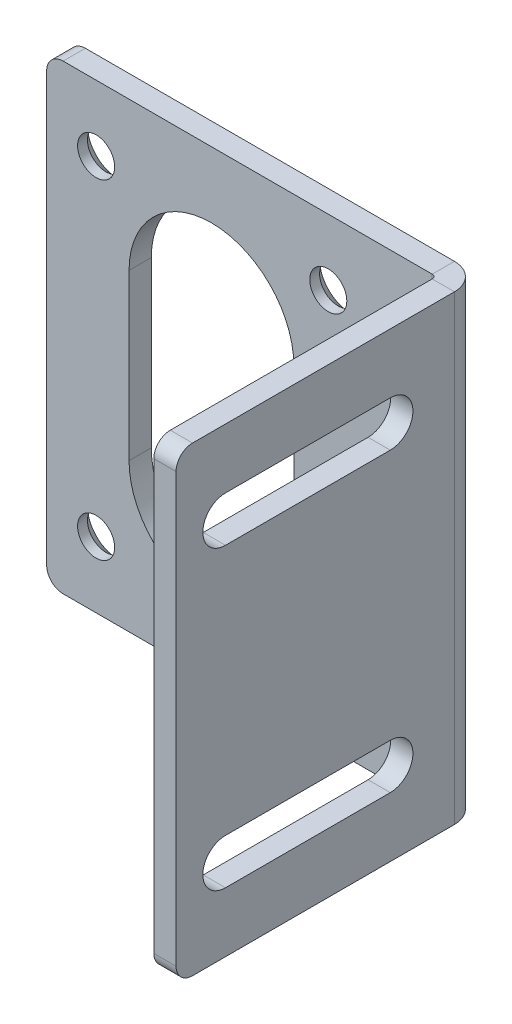
ISO-10303-21;
HEADER;
FILE_DESCRIPTION(('STEP AP214'),'2;1');
FILE_NAME('part.step','',(''),(''),'','','');
FILE_SCHEMA(('AUTOMOTIVE_DESIGN { 1 0 10303 214 1 1 1 1 }'));
ENDSEC;
DATA;
#1=APPLICATION_CONTEXT('core data for automotive mechanical design processes');
#2=APPLICATION_PROTOCOL_DEFINITION('international standard','automotive_design',2000,#1);
#3=PRODUCT_CONTEXT('',#1,'mechanical');
#4=PRODUCT('Part','Part','',(#3));
#5=PRODUCT_RELATED_PRODUCT_CATEGORY('part','',(#4));
#6=PRODUCT_DEFINITION_FORMATION('','',#4);
#7=PRODUCT_DEFINITION_CONTEXT('part definition',#1,'design');
#8=PRODUCT_DEFINITION('design','',#6,#7);
#9=PRODUCT_DEFINITION_SHAPE('','',#8);
#10=(LENGTH_UNIT() NAMED_UNIT(*) SI_UNIT(.MILLI.,.METRE.));
#11=(NAMED_UNIT(*) PLANE_ANGLE_UNIT() SI_UNIT($,.RADIAN.));
#12=(NAMED_UNIT(*) SI_UNIT($,.STERADIAN.) SOLID_ANGLE_UNIT());
#13=UNCERTAINTY_MEASURE_WITH_UNIT(LENGTH_MEASURE(1.E-05),#10,'distance_accuracy_value','');
#14=(GEOMETRIC_REPRESENTATION_CONTEXT(3) GLOBAL_UNCERTAINTY_ASSIGNED_CONTEXT((#13)) GLOBAL_UNIT_ASSIGNED_CONTEXT((#10,
#11,#12)) REPRESENTATION_CONTEXT('',''));
#15=CARTESIAN_POINT('',(0.,0.,0.));
#16=DIRECTION('',(0.,0.,1.));
#17=DIRECTION('',(1.,0.,0.));
#18=AXIS2_PLACEMENT_3D('',#15,#16,#17);
#19=CARTESIAN_POINT('',(5.55000000000018,-26.,-47.2059732045706));
#20=DIRECTION('',(1.,0.,0.));
#21=DIRECTION('',(0.,0.,-1.));
#22=AXIS2_PLACEMENT_3D('',#19,#20,#21);
#23=PLANE('',#22);
#24=DIRECTION('',(0.,0.,-1.));
#25=VECTOR('',#24,1.);
#26=CARTESIAN_POINT('',(5.54999999999991,20.75,28.2940267954294));
#27=LINE('',#26,#25);
#28=CARTESIAN_POINT('',(5.54999999999991,20.75,28.2940267954294));
#29=VERTEX_POINT('',#28);
#30=CARTESIAN_POINT('',(5.54999999999998,20.75,8.29402679542945));
#31=VERTEX_POINT('',#30);
#32=EDGE_CURVE('E369',#29,#31,#27,.T.);
#33=ORIENTED_EDGE('',*,*,#32,.F.);
#34=CARTESIAN_POINT('',(5.54999999999991,18.,28.2940267954294));
#35=DIRECTION('',(-1.,0.,0.));
#36=DIRECTION('',(0.,0.,1.));
#37=AXIS2_PLACEMENT_3D('',#34,#35,#36);
#38=CIRCLE('',#37,2.75);
#39=CARTESIAN_POINT('',(5.54999999999991,15.25,28.2940267954294));
#40=VERTEX_POINT('',#39);
#41=EDGE_CURVE('E347',#40,#29,#38,.T.);
#42=ORIENTED_EDGE('',*,*,#41,.F.);
#43=DIRECTION('',(0.,0.,1.));
#44=VECTOR('',#43,1.);
#45=CARTESIAN_POINT('',(5.54999999999991,15.25,28.2940267954294));
#46=LINE('',#45,#44);
#47=CARTESIAN_POINT('',(5.54999999999998,15.25,8.29402679542945));
#48=VERTEX_POINT('',#47);
#49=EDGE_CURVE('E358',#48,#40,#46,.T.);
#50=ORIENTED_EDGE('',*,*,#49,.F.);
#51=CARTESIAN_POINT('',(5.54999999999998,18.,8.29402679542945));
#52=DIRECTION('',(-1.,0.,0.));
#53=DIRECTION('',(0.,0.,1.));
#54=AXIS2_PLACEMENT_3D('',#51,#52,#53);
#55=CIRCLE('',#54,2.75);
#56=EDGE_CURVE('E372',#31,#48,#55,.T.);
#57=ORIENTED_EDGE('',*,*,#56,.F.);
#58=EDGE_LOOP('',(#33,#42,#50,#57));
#59=FACE_BOUND('',#58,.T.);
#60=DIRECTION('',(0.,0.,-1.));
#61=VECTOR('',#60,1.);
#62=CARTESIAN_POINT('',(5.54999999999992,-15.25,28.2940267954294));
#63=LINE('',#62,#61);
#64=CARTESIAN_POINT('',(5.54999999999992,-15.25,28.2940267954294));
#65=VERTEX_POINT('',#64);
#66=CARTESIAN_POINT('',(5.54999999999999,-15.25,8.29402679542944));
#67=VERTEX_POINT('',#66);
#68=EDGE_CURVE('E337',#65,#67,#63,.T.);
#69=ORIENTED_EDGE('',*,*,#68,.F.);
#70=CARTESIAN_POINT('',(5.54999999999992,-18.,28.2940267954294));
#71=DIRECTION('',(-1.,0.,0.));
#72=DIRECTION('',(0.,0.,1.));
#73=AXIS2_PLACEMENT_3D('',#70,#71,#72);
#74=CIRCLE('',#73,2.75);
#75=CARTESIAN_POINT('',(5.54999999999992,-20.75,28.2940267954294));
#76=VERTEX_POINT('',#75);
#77=EDGE_CURVE('E335',#76,#65,#74,.T.);
#78=ORIENTED_EDGE('',*,*,#77,.F.);
#79=DIRECTION('',(0.,0.,1.));
#80=VECTOR('',#79,1.);
#81=CARTESIAN_POINT('',(5.54999999999992,-20.75,28.2940267954294));
#82=LINE('',#81,#80);
#83=CARTESIAN_POINT('',(5.54999999999999,-20.75,8.29402679542944));
#84=VERTEX_POINT('',#83);
#85=EDGE_CURVE('E325',#84,#76,#82,.T.);
#86=ORIENTED_EDGE('',*,*,#85,.F.);
#87=CARTESIAN_POINT('',(5.54999999999999,-18.,8.29402679542944));
#88=DIRECTION('',(-1.,0.,0.));
#89=DIRECTION('',(0.,0.,1.));
#90=AXIS2_PLACEMENT_3D('',#87,#88,#89);
#91=CIRCLE('',#90,2.75);
#92=EDGE_CURVE('E340',#67,#84,#91,.T.);
#93=ORIENTED_EDGE('',*,*,#92,.F.);
#94=EDGE_LOOP('',(#69,#78,#86,#93));
#95=FACE_BOUND('',#94,.T.);
#96=DIRECTION('',(0.,0.,-1.));
#97=VECTOR('',#96,1.);
#98=CARTESIAN_POINT('',(5.55000000000018,28.,-47.2059732045706));
#99=LINE('',#98,#97);
#100=CARTESIAN_POINT('',(5.5499999999999,28.,32.2940267954294));
#101=VERTEX_POINT('',#100);
#102=CARTESIAN_POINT('',(5.55000000000001,28.,0.499999999999988));
#103=VERTEX_POINT('',#102);
#104=EDGE_CURVE('E56',#101,#103,#99,.T.);
#105=ORIENTED_EDGE('',*,*,#104,.T.);
#106=DIRECTION('',(0.,-1.,0.));
#107=VECTOR('',#106,1.);
#108=CARTESIAN_POINT('',(5.55000000000002,-26.,0.500000000000009));
#109=LINE('',#108,#107);
#110=CARTESIAN_POINT('',(5.55000000000002,-28.,0.500000000000009));
#111=VERTEX_POINT('',#110);
#112=EDGE_CURVE('E417',#103,#111,#109,.T.);
#113=ORIENTED_EDGE('',*,*,#112,.T.);
#114=DIRECTION('',(0.,0.,1.));
#115=VECTOR('',#114,1.);
#116=CARTESIAN_POINT('',(5.55000000000018,-28.,-47.2059732045706));
#117=LINE('',#116,#115);
#118=CARTESIAN_POINT('',(5.5499999999999,-28.,32.2940267954294));
#119=VERTEX_POINT('',#118);
#120=EDGE_CURVE('E64',#111,#119,#117,.T.);
#121=ORIENTED_EDGE('',*,*,#120,.T.);
#122=CARTESIAN_POINT('',(5.5499999999999,-26.,32.2940267954294));
#123=DIRECTION('',(-1.,0.,0.));
#124=DIRECTION('',(0.,0.,1.));
#125=AXIS2_PLACEMENT_3D('',#122,#123,#124);
#126=CIRCLE('',#125,2.);
#127=CARTESIAN_POINT('',(5.5499999999999,-26.,34.2940267954294));
#128=VERTEX_POINT('',#127);
#129=EDGE_CURVE('E396',#119,#128,#126,.T.);
#130=ORIENTED_EDGE('',*,*,#129,.T.);
#131=DIRECTION('',(0.,1.,0.));
#132=VECTOR('',#131,1.);
#133=CARTESIAN_POINT('',(5.54999999999989,26.,34.2940267954294));
#134=LINE('',#133,#132);
#135=CARTESIAN_POINT('',(5.54999999999989,26.,34.2940267954294));
#136=VERTEX_POINT('',#135);
#137=EDGE_CURVE('E399',#128,#136,#134,.T.);
#138=ORIENTED_EDGE('',*,*,#137,.T.);
#139=CARTESIAN_POINT('',(5.5499999999999,26.,32.2940267954294));
#140=DIRECTION('',(-1.,0.,0.));
#141=DIRECTION('',(0.,0.,1.));
#142=AXIS2_PLACEMENT_3D('',#139,#140,#141);
#143=CIRCLE('',#142,2.);
#144=EDGE_CURVE('E402',#136,#101,#143,.T.);
#145=ORIENTED_EDGE('',*,*,#144,.T.);
#146=EDGE_LOOP('',(#105,#113,#121,#130,#138,#145));
#147=FACE_BOUND('',#146,.T.);
#148=ADVANCED_FACE('F41',(#59,#95,#147),#23,.F.);
#149=CARTESIAN_POINT('',(8.25000000000018,28.,-47.2059732045706));
#150=DIRECTION('',(0.,1.,0.));
#151=DIRECTION('',(-1.,0.,0.));
#152=AXIS2_PLACEMENT_3D('',#149,#150,#151);
#153=PLANE('',#152);
#154=DIRECTION('',(1.,0.,0.));
#155=VECTOR('',#154,1.);
#156=CARTESIAN_POINT('',(8.25000000000001,28.,0.500000000000011));
#157=LINE('',#156,#155);
#158=CARTESIAN_POINT('',(8.25000000000001,28.,0.500000000000011));
#159=VERTEX_POINT('',#158);
#160=EDGE_CURVE('E210',#103,#159,#157,.T.);
#161=ORIENTED_EDGE('',*,*,#160,.F.);
#162=ORIENTED_EDGE('',*,*,#104,.F.);
#163=DIRECTION('',(-1.,0.,0.));
#164=VECTOR('',#163,1.);
#165=CARTESIAN_POINT('',(8.2499999999999,28.,32.2940267954294));
#166=LINE('',#165,#164);
#167=CARTESIAN_POINT('',(8.2499999999999,28.,32.2940267954294));
#168=VERTEX_POINT('',#167);
#169=EDGE_CURVE('E404',#168,#101,#166,.T.);
#170=ORIENTED_EDGE('',*,*,#169,.F.);
#171=DIRECTION('',(0.,0.,-1.));
#172=VECTOR('',#171,1.);
#173=CARTESIAN_POINT('',(8.25000000000018,28.,-47.2059732045706));
#174=LINE('',#173,#172);
#175=EDGE_CURVE('E395',#168,#159,#174,.T.);
#176=ORIENTED_EDGE('',*,*,#175,.T.);
#177=EDGE_LOOP('',(#161,#162,#170,#176));
#178=FACE_BOUND('',#177,.T.);
#179=ADVANCED_FACE('F457',(#178),#153,.T.);
#180=CARTESIAN_POINT('',(8.2499999999999,26.,32.2940267954294));
#181=DIRECTION('',(-1.,0.,0.));
#182=DIRECTION('',(0.,0.,1.));
#183=AXIS2_PLACEMENT_3D('',#180,#181,#182);
#184=CYLINDRICAL_SURFACE('',#183,2.);
#185=ORIENTED_EDGE('',*,*,#144,.F.);
#186=DIRECTION('',(-1.,0.,0.));
#187=VECTOR('',#186,1.);
#188=CARTESIAN_POINT('',(8.24999999999989,26.,34.2940267954294));
#189=LINE('',#188,#187);
#190=CARTESIAN_POINT('',(8.24999999999989,26.,34.2940267954294));
#191=VERTEX_POINT('',#190);
#192=EDGE_CURVE('E407',#191,#136,#189,.T.);
#193=ORIENTED_EDGE('',*,*,#192,.F.);
#194=CARTESIAN_POINT('',(8.2499999999999,26.,32.2940267954294));
#195=DIRECTION('',(-1.,0.,0.));
#196=DIRECTION('',(0.,0.,1.));
#197=AXIS2_PLACEMENT_3D('',#194,#195,#196);
#198=CIRCLE('',#197,2.);
#199=EDGE_CURVE('E392',#191,#168,#198,.T.);
#200=ORIENTED_EDGE('',*,*,#199,.T.);
#201=ORIENTED_EDGE('',*,*,#169,.T.);
#202=EDGE_LOOP('',(#185,#193,#200,#201));
#203=FACE_BOUND('',#202,.T.);
#204=ADVANCED_FACE('F463',(#203),#184,.T.);
#205=CARTESIAN_POINT('',(8.24999999999989,26.,34.2940267954294));
#206=DIRECTION('',(0.,0.,1.));
#207=DIRECTION('',(1.,0.,0.));
#208=AXIS2_PLACEMENT_3D('',#205,#206,#207);
#209=PLANE('',#208);
#210=ORIENTED_EDGE('',*,*,#137,.F.);
#211=DIRECTION('',(-1.,0.,0.));
#212=VECTOR('',#211,1.);
#213=CARTESIAN_POINT('',(8.2499999999999,-26.,34.2940267954294));
#214=LINE('',#213,#212);
#215=CARTESIAN_POINT('',(8.2499999999999,-26.,34.2940267954294));
#216=VERTEX_POINT('',#215);
#217=EDGE_CURVE('E409',#216,#128,#214,.T.);
#218=ORIENTED_EDGE('',*,*,#217,.F.);
#219=DIRECTION('',(0.,1.,0.));
#220=VECTOR('',#219,1.);
#221=CARTESIAN_POINT('',(8.24999999999989,26.,34.2940267954294));
#222=LINE('',#221,#220);
#223=EDGE_CURVE('E388',#216,#191,#222,.T.);
#224=ORIENTED_EDGE('',*,*,#223,.T.);
#225=ORIENTED_EDGE('',*,*,#192,.T.);
#226=EDGE_LOOP('',(#210,#218,#224,#225));
#227=FACE_BOUND('',#226,.T.);
#228=ADVANCED_FACE('F575',(#227),#209,.T.);
#229=CARTESIAN_POINT('',(8.24999999999991,-26.,32.2940267954294));
#230=DIRECTION('',(-1.,0.,0.));
#231=DIRECTION('',(0.,0.,1.));
#232=AXIS2_PLACEMENT_3D('',#229,#230,#231);
#233=CYLINDRICAL_SURFACE('',#232,2.);
#234=ORIENTED_EDGE('',*,*,#129,.F.);
#235=DIRECTION('',(-1.,0.,0.));
#236=VECTOR('',#235,1.);
#237=CARTESIAN_POINT('',(8.24999999999991,-28.,32.2940267954294));
#238=LINE('',#237,#236);
#239=CARTESIAN_POINT('',(8.24999999999991,-28.,32.2940267954294));
#240=VERTEX_POINT('',#239);
#241=EDGE_CURVE('E411',#240,#119,#238,.T.);
#242=ORIENTED_EDGE('',*,*,#241,.F.);
#243=CARTESIAN_POINT('',(8.24999999999991,-26.,32.2940267954294));
#244=DIRECTION('',(-1.,0.,0.));
#245=DIRECTION('',(0.,0.,1.));
#246=AXIS2_PLACEMENT_3D('',#243,#244,#245);
#247=CIRCLE('',#246,2.);
#248=EDGE_CURVE('E385',#240,#216,#247,.T.);
#249=ORIENTED_EDGE('',*,*,#248,.T.);
#250=ORIENTED_EDGE('',*,*,#217,.T.);
#251=EDGE_LOOP('',(#234,#242,#249,#250));
#252=FACE_BOUND('',#251,.T.);
#253=ADVANCED_FACE('F579',(#252),#233,.T.);
#254=CARTESIAN_POINT('',(8.25000000000018,-28.,-47.2059732045706));
#255=DIRECTION('',(0.,-1.,0.));
#256=DIRECTION('',(1.,0.,0.));
#257=AXIS2_PLACEMENT_3D('',#254,#255,#256);
#258=PLANE('',#257);
#259=DIRECTION('',(-1.,0.,0.));
#260=VECTOR('',#259,1.);
#261=CARTESIAN_POINT('',(8.25000000000002,-28.,0.500000000000018));
#262=LINE('',#261,#260);
#263=CARTESIAN_POINT('',(8.25000000000002,-28.,0.500000000000003));
#264=VERTEX_POINT('',#263);
#265=EDGE_CURVE('E414',#264,#111,#262,.T.);
#266=ORIENTED_EDGE('',*,*,#265,.F.);
#267=DIRECTION('',(0.,0.,1.));
#268=VECTOR('',#267,1.);
#269=CARTESIAN_POINT('',(8.25000000000018,-28.,-47.2059732045706));
#270=LINE('',#269,#268);
#271=EDGE_CURVE('E389',#264,#240,#270,.T.);
#272=ORIENTED_EDGE('',*,*,#271,.T.);
#273=ORIENTED_EDGE('',*,*,#241,.T.);
#274=ORIENTED_EDGE('',*,*,#120,.F.);
#275=EDGE_LOOP('',(#266,#272,#273,#274));
#276=FACE_BOUND('',#275,.T.);
#277=ADVANCED_FACE('F469',(#276),#258,.T.);
#278=CARTESIAN_POINT('',(8.25000000000018,-26.,-47.2059732045706));
#279=DIRECTION('',(1.,0.,0.));
#280=DIRECTION('',(0.,0.,-1.));
#281=AXIS2_PLACEMENT_3D('',#278,#279,#280);
#282=PLANE('',#281);
#283=DIRECTION('',(0.,-1.,0.));
#284=VECTOR('',#283,1.);
#285=CARTESIAN_POINT('',(8.25000000000002,-26.,0.500000000000018));
#286=LINE('',#285,#284);
#287=EDGE_CURVE('E406',#159,#264,#286,.T.);
#288=ORIENTED_EDGE('',*,*,#287,.F.);
#289=ORIENTED_EDGE('',*,*,#175,.F.);
#290=ORIENTED_EDGE('',*,*,#199,.F.);
#291=ORIENTED_EDGE('',*,*,#223,.F.);
#292=ORIENTED_EDGE('',*,*,#248,.F.);
#293=ORIENTED_EDGE('',*,*,#271,.F.);
#294=EDGE_LOOP('',(#288,#289,#290,#291,#292,#293));
#295=FACE_BOUND('',#294,.T.);
#296=CARTESIAN_POINT('',(8.24999999999992,-18.,28.2940267954294));
#297=DIRECTION('',(-1.,0.,0.));
#298=DIRECTION('',(0.,0.,1.));
#299=AXIS2_PLACEMENT_3D('',#296,#297,#298);
#300=CIRCLE('',#299,2.75);
#301=CARTESIAN_POINT('',(8.24999999999992,-20.75,28.2940267954294));
#302=VERTEX_POINT('',#301);
#303=CARTESIAN_POINT('',(8.24999999999992,-15.25,28.2940267954294));
#304=VERTEX_POINT('',#303);
#305=EDGE_CURVE('E321',#302,#304,#300,.T.);
#306=ORIENTED_EDGE('',*,*,#305,.T.);
#307=DIRECTION('',(0.,0.,-1.));
#308=VECTOR('',#307,1.);
#309=CARTESIAN_POINT('',(8.24999999999992,-15.25,28.2940267954294));
#310=LINE('',#309,#308);
#311=CARTESIAN_POINT('',(8.24999999999999,-15.25,8.29402679542945));
#312=VERTEX_POINT('',#311);
#313=EDGE_CURVE('E324',#304,#312,#310,.T.);
#314=ORIENTED_EDGE('',*,*,#313,.T.);
#315=CARTESIAN_POINT('',(8.24999999999999,-18.,8.29402679542945));
#316=DIRECTION('',(-1.,0.,0.));
#317=DIRECTION('',(0.,0.,1.));
#318=AXIS2_PLACEMENT_3D('',#315,#316,#317);
#319=CIRCLE('',#318,2.75);
#320=CARTESIAN_POINT('',(8.24999999999999,-20.75,8.29402679542945));
#321=VERTEX_POINT('',#320);
#322=EDGE_CURVE('E328',#312,#321,#319,.T.);
#323=ORIENTED_EDGE('',*,*,#322,.T.);
#324=DIRECTION('',(0.,0.,1.));
#325=VECTOR('',#324,1.);
#326=CARTESIAN_POINT('',(8.24999999999992,-20.75,28.2940267954294));
#327=LINE('',#326,#325);
#328=EDGE_CURVE('E331',#321,#302,#327,.T.);
#329=ORIENTED_EDGE('',*,*,#328,.T.);
#330=EDGE_LOOP('',(#306,#314,#323,#329));
#331=FACE_BOUND('',#330,.T.);
#332=CARTESIAN_POINT('',(8.24999999999991,18.,28.2940267954294));
#333=DIRECTION('',(-1.,0.,0.));
#334=DIRECTION('',(0.,0.,1.));
#335=AXIS2_PLACEMENT_3D('',#332,#333,#334);
#336=CIRCLE('',#335,2.75);
#337=CARTESIAN_POINT('',(8.24999999999991,15.25,28.2940267954294));
#338=VERTEX_POINT('',#337);
#339=CARTESIAN_POINT('',(8.24999999999991,20.75,28.2940267954294));
#340=VERTEX_POINT('',#339);
#341=EDGE_CURVE('E354',#338,#340,#336,.T.);
#342=ORIENTED_EDGE('',*,*,#341,.T.);
#343=DIRECTION('',(0.,0.,-1.));
#344=VECTOR('',#343,1.);
#345=CARTESIAN_POINT('',(8.24999999999991,20.75,28.2940267954294));
#346=LINE('',#345,#344);
#347=CARTESIAN_POINT('',(8.24999999999998,20.75,8.29402679542946));
#348=VERTEX_POINT('',#347);
#349=EDGE_CURVE('E357',#340,#348,#346,.T.);
#350=ORIENTED_EDGE('',*,*,#349,.T.);
#351=CARTESIAN_POINT('',(8.24999999999998,18.,8.29402679542946));
#352=DIRECTION('',(-1.,0.,0.));
#353=DIRECTION('',(0.,0.,1.));
#354=AXIS2_PLACEMENT_3D('',#351,#352,#353);
#355=CIRCLE('',#354,2.75);
#356=CARTESIAN_POINT('',(8.24999999999998,15.25,8.29402679542946));
#357=VERTEX_POINT('',#356);
#358=EDGE_CURVE('E361',#348,#357,#355,.T.);
#359=ORIENTED_EDGE('',*,*,#358,.T.);
#360=DIRECTION('',(0.,0.,1.));
#361=VECTOR('',#360,1.);
#362=CARTESIAN_POINT('',(8.24999999999991,15.25,28.2940267954294));
#363=LINE('',#362,#361);
#364=EDGE_CURVE('E364',#357,#338,#363,.T.);
#365=ORIENTED_EDGE('',*,*,#364,.T.);
#366=EDGE_LOOP('',(#342,#350,#359,#365));
#367=FACE_BOUND('',#366,.T.);
#368=ADVANCED_FACE('F571',(#295,#331,#367),#282,.T.);
#369=CARTESIAN_POINT('',(8.24999999999991,18.,28.2940267954294));
#370=DIRECTION('',(-1.,0.,0.));
#371=DIRECTION('',(0.,0.,1.));
#372=AXIS2_PLACEMENT_3D('',#369,#370,#371);
#373=CYLINDRICAL_SURFACE('',#372,2.75);
#374=ORIENTED_EDGE('',*,*,#41,.T.);
#375=DIRECTION('',(-1.,0.,0.));
#376=VECTOR('',#375,1.);
#377=CARTESIAN_POINT('',(8.24999999999991,20.75,28.2940267954294));
#378=LINE('',#377,#376);
#379=EDGE_CURVE('E367',#340,#29,#378,.T.);
#380=ORIENTED_EDGE('',*,*,#379,.F.);
#381=ORIENTED_EDGE('',*,*,#341,.F.);
#382=DIRECTION('',(-1.,0.,0.));
#383=VECTOR('',#382,1.);
#384=CARTESIAN_POINT('',(8.24999999999991,15.25,28.2940267954294));
#385=LINE('',#384,#383);
#386=EDGE_CURVE('E377',#338,#40,#385,.T.);
#387=ORIENTED_EDGE('',*,*,#386,.T.);
#388=EDGE_LOOP('',(#374,#380,#381,#387));
#389=FACE_BOUND('',#388,.T.);
#390=ADVANCED_FACE('F561',(#389),#373,.F.);
#391=CARTESIAN_POINT('',(8.24999999999991,15.25,28.2940267954294));
#392=DIRECTION('',(0.,-1.,0.));
#393=DIRECTION('',(0.,0.,1.));
#394=AXIS2_PLACEMENT_3D('',#391,#392,#393);
#395=PLANE('',#394);
#396=ORIENTED_EDGE('',*,*,#49,.T.);
#397=ORIENTED_EDGE('',*,*,#386,.F.);
#398=ORIENTED_EDGE('',*,*,#364,.F.);
#399=DIRECTION('',(-1.,0.,0.));
#400=VECTOR('',#399,1.);
#401=CARTESIAN_POINT('',(8.24999999999998,15.25,8.29402679542946));
#402=LINE('',#401,#400);
#403=EDGE_CURVE('E379',#357,#48,#402,.T.);
#404=ORIENTED_EDGE('',*,*,#403,.T.);
#405=EDGE_LOOP('',(#396,#397,#398,#404));
#406=FACE_BOUND('',#405,.T.);
#407=ADVANCED_FACE('F557',(#406),#395,.F.);
#408=CARTESIAN_POINT('',(8.24999999999998,18.,8.29402679542946));
#409=DIRECTION('',(-1.,0.,0.));
#410=DIRECTION('',(0.,0.,1.));
#411=AXIS2_PLACEMENT_3D('',#408,#409,#410);
#412=CYLINDRICAL_SURFACE('',#411,2.75);
#413=ORIENTED_EDGE('',*,*,#56,.T.);
#414=ORIENTED_EDGE('',*,*,#403,.F.);
#415=ORIENTED_EDGE('',*,*,#358,.F.);
#416=DIRECTION('',(-1.,0.,0.));
#417=VECTOR('',#416,1.);
#418=CARTESIAN_POINT('',(8.24999999999998,20.75,8.29402679542946));
#419=LINE('',#418,#417);
#420=EDGE_CURVE('E381',#348,#31,#419,.T.);
#421=ORIENTED_EDGE('',*,*,#420,.T.);
#422=EDGE_LOOP('',(#413,#414,#415,#421));
#423=FACE_BOUND('',#422,.T.);
#424=ADVANCED_FACE('F560',(#423),#412,.F.);
#425=CARTESIAN_POINT('',(8.24999999999991,20.75,28.2940267954294));
#426=DIRECTION('',(0.,1.,0.));
#427=DIRECTION('',(0.,0.,-1.));
#428=AXIS2_PLACEMENT_3D('',#425,#426,#427);
#429=PLANE('',#428);
#430=ORIENTED_EDGE('',*,*,#32,.T.);
#431=ORIENTED_EDGE('',*,*,#420,.F.);
#432=ORIENTED_EDGE('',*,*,#349,.F.);
#433=ORIENTED_EDGE('',*,*,#379,.T.);
#434=EDGE_LOOP('',(#430,#431,#432,#433));
#435=FACE_BOUND('',#434,.T.);
#436=ADVANCED_FACE('F555',(#435),#429,.F.);
#437=CARTESIAN_POINT('',(8.24999999999992,-18.,28.2940267954294));
#438=DIRECTION('',(-1.,0.,0.));
#439=DIRECTION('',(0.,0.,1.));
#440=AXIS2_PLACEMENT_3D('',#437,#438,#439);
#441=CYLINDRICAL_SURFACE('',#440,2.75);
#442=ORIENTED_EDGE('',*,*,#77,.T.);
#443=DIRECTION('',(-1.,0.,0.));
#444=VECTOR('',#443,1.);
#445=CARTESIAN_POINT('',(8.24999999999992,-15.25,28.2940267954294));
#446=LINE('',#445,#444);
#447=EDGE_CURVE('E334',#304,#65,#446,.T.);
#448=ORIENTED_EDGE('',*,*,#447,.F.);
#449=ORIENTED_EDGE('',*,*,#305,.F.);
#450=DIRECTION('',(-1.,0.,0.));
#451=VECTOR('',#450,1.);
#452=CARTESIAN_POINT('',(8.24999999999992,-20.75,28.2940267954294));
#453=LINE('',#452,#451);
#454=EDGE_CURVE('E345',#302,#76,#453,.T.);
#455=ORIENTED_EDGE('',*,*,#454,.T.);
#456=EDGE_LOOP('',(#442,#448,#449,#455));
#457=FACE_BOUND('',#456,.T.);
#458=ADVANCED_FACE('F543',(#457),#441,.F.);
#459=CARTESIAN_POINT('',(8.24999999999992,-20.75,28.2940267954294));
#460=DIRECTION('',(0.,-1.,0.));
#461=DIRECTION('',(0.,0.,1.));
#462=AXIS2_PLACEMENT_3D('',#459,#460,#461);
#463=PLANE('',#462);
#464=ORIENTED_EDGE('',*,*,#85,.T.);
#465=ORIENTED_EDGE('',*,*,#454,.F.);
#466=ORIENTED_EDGE('',*,*,#328,.F.);
#467=DIRECTION('',(-1.,0.,0.));
#468=VECTOR('',#467,1.);
#469=CARTESIAN_POINT('',(8.24999999999999,-20.75,8.29402679542945));
#470=LINE('',#469,#468);
#471=EDGE_CURVE('E348',#321,#84,#470,.T.);
#472=ORIENTED_EDGE('',*,*,#471,.T.);
#473=EDGE_LOOP('',(#464,#465,#466,#472));
#474=FACE_BOUND('',#473,.T.);
#475=ADVANCED_FACE('F539',(#474),#463,.F.);
#476=CARTESIAN_POINT('',(8.24999999999999,-18.,8.29402679542945));
#477=DIRECTION('',(-1.,0.,0.));
#478=DIRECTION('',(0.,0.,1.));
#479=AXIS2_PLACEMENT_3D('',#476,#477,#478);
#480=CYLINDRICAL_SURFACE('',#479,2.75);
#481=ORIENTED_EDGE('',*,*,#92,.T.);
#482=ORIENTED_EDGE('',*,*,#471,.F.);
#483=ORIENTED_EDGE('',*,*,#322,.F.);
#484=DIRECTION('',(-1.,0.,0.));
#485=VECTOR('',#484,1.);
#486=CARTESIAN_POINT('',(8.24999999999999,-15.25,8.29402679542945));
#487=LINE('',#486,#485);
#488=EDGE_CURVE('E350',#312,#67,#487,.T.);
#489=ORIENTED_EDGE('',*,*,#488,.T.);
#490=EDGE_LOOP('',(#481,#482,#483,#489));
#491=FACE_BOUND('',#490,.T.);
#492=ADVANCED_FACE('F542',(#491),#480,.F.);
#493=CARTESIAN_POINT('',(8.24999999999992,-15.25,28.2940267954294));
#494=DIRECTION('',(0.,1.,0.));
#495=DIRECTION('',(0.,0.,-1.));
#496=AXIS2_PLACEMENT_3D('',#493,#494,#495);
#497=PLANE('',#496);
#498=ORIENTED_EDGE('',*,*,#68,.T.);
#499=ORIENTED_EDGE('',*,*,#488,.F.);
#500=ORIENTED_EDGE('',*,*,#313,.F.);
#501=ORIENTED_EDGE('',*,*,#447,.T.);
#502=EDGE_LOOP('',(#498,#499,#500,#501));
#503=FACE_BOUND('',#502,.T.);
#504=ADVANCED_FACE('F547',(#503),#497,.F.);
#505=CARTESIAN_POINT('',(-39.75,26.,-2.7));
#506=DIRECTION('',(0.,0.,1.));
#507=DIRECTION('',(1.,0.,0.));
#508=AXIS2_PLACEMENT_3D('',#505,#506,#507);
#509=CYLINDRICAL_SURFACE('',#508,2.);
#510=CARTESIAN_POINT('',(-39.75,26.,0.));
#511=DIRECTION('',(0.,0.,1.));
#512=DIRECTION('',(-1.,0.,0.));
#513=AXIS2_PLACEMENT_3D('',#510,#511,#512);
#514=CIRCLE('',#513,2.);
#515=CARTESIAN_POINT('',(-39.75,28.,0.));
#516=VERTEX_POINT('',#515);
#517=CARTESIAN_POINT('',(-41.75,26.,0.));
#518=VERTEX_POINT('',#517);
#519=EDGE_CURVE('E255',#516,#518,#514,.T.);
#520=ORIENTED_EDGE('',*,*,#519,.F.);
#521=DIRECTION('',(0.,0.,1.));
#522=VECTOR('',#521,1.);
#523=CARTESIAN_POINT('',(-39.75,28.,-2.7));
#524=LINE('',#523,#522);
#525=CARTESIAN_POINT('',(-39.75,28.,-2.7));
#526=VERTEX_POINT('',#525);
#527=EDGE_CURVE('E237',#526,#516,#524,.T.);
#528=ORIENTED_EDGE('',*,*,#527,.F.);
#529=CARTESIAN_POINT('',(-39.75,26.,-2.7));
#530=DIRECTION('',(0.,0.,1.));
#531=DIRECTION('',(-1.,0.,0.));
#532=AXIS2_PLACEMENT_3D('',#529,#530,#531);
#533=CIRCLE('',#532,2.);
#534=CARTESIAN_POINT('',(-41.75,26.,-2.7));
#535=VERTEX_POINT('',#534);
#536=EDGE_CURVE('E233',#526,#535,#533,.T.);
#537=ORIENTED_EDGE('',*,*,#536,.T.);
#538=DIRECTION('',(0.,0.,1.));
#539=VECTOR('',#538,1.);
#540=CARTESIAN_POINT('',(-41.75,26.,-2.7));
#541=LINE('',#540,#539);
#542=EDGE_CURVE('E316',#535,#518,#541,.T.);
#543=ORIENTED_EDGE('',*,*,#542,.T.);
#544=EDGE_LOOP('',(#520,#528,#537,#543));
#545=FACE_BOUND('',#544,.T.);
#546=ADVANCED_FACE('F551',(#545),#509,.T.);
#547=CARTESIAN_POINT('',(-41.75,26.,-2.7));
#548=DIRECTION('',(-1.,0.,0.));
#549=DIRECTION('',(0.,-1.,0.));
#550=AXIS2_PLACEMENT_3D('',#547,#548,#549);
#551=PLANE('',#550);
#552=DIRECTION('',(0.,-1.,0.));
#553=VECTOR('',#552,1.);
#554=CARTESIAN_POINT('',(-41.75,26.,0.));
#555=LINE('',#554,#553);
#556=CARTESIAN_POINT('',(-41.75,-26.,0.));
#557=VERTEX_POINT('',#556);
#558=EDGE_CURVE('E252',#518,#557,#555,.T.);
#559=ORIENTED_EDGE('',*,*,#558,.F.);
#560=ORIENTED_EDGE('',*,*,#542,.F.);
#561=DIRECTION('',(0.,-1.,0.));
#562=VECTOR('',#561,1.);
#563=CARTESIAN_POINT('',(-41.75,26.,-2.7));
#564=LINE('',#563,#562);
#565=CARTESIAN_POINT('',(-41.75,-26.,-2.7));
#566=VERTEX_POINT('',#565);
#567=EDGE_CURVE('E313',#535,#566,#564,.T.);
#568=ORIENTED_EDGE('',*,*,#567,.T.);
#569=DIRECTION('',(0.,0.,1.));
#570=VECTOR('',#569,1.);
#571=CARTESIAN_POINT('',(-41.75,-26.,-2.7));
#572=LINE('',#571,#570);
#573=EDGE_CURVE('E311',#566,#557,#572,.T.);
#574=ORIENTED_EDGE('',*,*,#573,.T.);
#575=EDGE_LOOP('',(#559,#560,#568,#574));
#576=FACE_BOUND('',#575,.T.);
#577=ADVANCED_FACE('F628',(#576),#551,.T.);
#578=CARTESIAN_POINT('',(-39.75,-26.,-2.7));
#579=DIRECTION('',(0.,0.,1.));
#580=DIRECTION('',(1.,0.,0.));
#581=AXIS2_PLACEMENT_3D('',#578,#579,#580);
#582=CYLINDRICAL_SURFACE('',#581,2.00000000000001);
#583=CARTESIAN_POINT('',(-39.75,-26.,0.));
#584=DIRECTION('',(0.,0.,1.));
#585=DIRECTION('',(-1.,0.,0.));
#586=AXIS2_PLACEMENT_3D('',#583,#584,#585);
#587=CIRCLE('',#586,2.00000000000001);
#588=CARTESIAN_POINT('',(-39.75,-28.,0.));
#589=VERTEX_POINT('',#588);
#590=EDGE_CURVE('E246',#557,#589,#587,.T.);
#591=ORIENTED_EDGE('',*,*,#590,.F.);
#592=ORIENTED_EDGE('',*,*,#573,.F.);
#593=CARTESIAN_POINT('',(-39.75,-26.,-2.7));
#594=DIRECTION('',(0.,0.,1.));
#595=DIRECTION('',(-1.,0.,0.));
#596=AXIS2_PLACEMENT_3D('',#593,#594,#595);
#597=CIRCLE('',#596,2.00000000000001);
#598=CARTESIAN_POINT('',(-39.75,-28.,-2.7));
#599=VERTEX_POINT('',#598);
#600=EDGE_CURVE('E308',#566,#599,#597,.T.);
#601=ORIENTED_EDGE('',*,*,#600,.T.);
#602=DIRECTION('',(0.,0.,1.));
#603=VECTOR('',#602,1.);
#604=CARTESIAN_POINT('',(-39.75,-28.,-2.7));
#605=LINE('',#604,#603);
#606=EDGE_CURVE('E306',#599,#589,#605,.T.);
#607=ORIENTED_EDGE('',*,*,#606,.T.);
#608=EDGE_LOOP('',(#591,#592,#601,#607));
#609=FACE_BOUND('',#608,.T.);
#610=ADVANCED_FACE('F632',(#609),#582,.T.);
#611=CARTESIAN_POINT('',(-31.75,-10.,-2.7));
#612=DIRECTION('',(-1.,0.,0.));
#613=DIRECTION('',(0.,0.,1.));
#614=AXIS2_PLACEMENT_3D('',#611,#612,#613);
#615=PLANE('',#614);
#616=DIRECTION('',(0.,-1.,0.));
#617=VECTOR('',#616,1.);
#618=CARTESIAN_POINT('',(-31.75,-10.,0.));
#619=LINE('',#618,#617);
#620=CARTESIAN_POINT('',(-31.75,10.,0.));
#621=VERTEX_POINT('',#620);
#622=CARTESIAN_POINT('',(-31.75,-10.,0.));
#623=VERTEX_POINT('',#622);
#624=EDGE_CURVE('E303',#621,#623,#619,.T.);
#625=ORIENTED_EDGE('',*,*,#624,.T.);
#626=DIRECTION('',(0.,0.,1.));
#627=VECTOR('',#626,1.);
#628=CARTESIAN_POINT('',(-31.75,-10.,-2.7));
#629=LINE('',#628,#627);
#630=CARTESIAN_POINT('',(-31.75,-10.,-2.7));
#631=VERTEX_POINT('',#630);
#632=EDGE_CURVE('E286',#631,#623,#629,.T.);
#633=ORIENTED_EDGE('',*,*,#632,.F.);
#634=DIRECTION('',(0.,-1.,0.));
#635=VECTOR('',#634,1.);
#636=CARTESIAN_POINT('',(-31.75,-10.,-2.7));
#637=LINE('',#636,#635);
#638=CARTESIAN_POINT('',(-31.75,10.,-2.7));
#639=VERTEX_POINT('',#638);
#640=EDGE_CURVE('E226',#639,#631,#637,.T.);
#641=ORIENTED_EDGE('',*,*,#640,.F.);
#642=DIRECTION('',(0.,0.,1.));
#643=VECTOR('',#642,1.);
#644=CARTESIAN_POINT('',(-31.75,10.,-2.7));
#645=LINE('',#644,#643);
#646=EDGE_CURVE('E301',#639,#621,#645,.T.);
#647=ORIENTED_EDGE('',*,*,#646,.T.);
#648=EDGE_LOOP('',(#625,#633,#641,#647));
#649=FACE_BOUND('',#648,.T.);
#650=ADVANCED_FACE('F507',(#649),#615,.F.);
#651=CARTESIAN_POINT('',(-21.75,10.,-2.7));
#652=DIRECTION('',(0.,0.,1.));
#653=DIRECTION('',(1.,0.,0.));
#654=AXIS2_PLACEMENT_3D('',#651,#652,#653);
#655=CYLINDRICAL_SURFACE('',#654,10.);
#656=CARTESIAN_POINT('',(-21.75,10.,0.));
#657=DIRECTION('',(0.,0.,1.));
#658=DIRECTION('',(1.,0.,0.));
#659=AXIS2_PLACEMENT_3D('',#656,#657,#658);
#660=CIRCLE('',#659,10.);
#661=CARTESIAN_POINT('',(-11.75,10.,0.));
#662=VERTEX_POINT('',#661);
#663=EDGE_CURVE('E298',#662,#621,#660,.T.);
#664=ORIENTED_EDGE('',*,*,#663,.T.);
#665=ORIENTED_EDGE('',*,*,#646,.F.);
#666=CARTESIAN_POINT('',(-21.75,10.,-2.7));
#667=DIRECTION('',(0.,0.,1.));
#668=DIRECTION('',(1.,0.,0.));
#669=AXIS2_PLACEMENT_3D('',#666,#667,#668);
#670=CIRCLE('',#669,10.);
#671=CARTESIAN_POINT('',(-11.75,10.,-2.7));
#672=VERTEX_POINT('',#671);
#673=EDGE_CURVE('E265',#672,#639,#670,.T.);
#674=ORIENTED_EDGE('',*,*,#673,.F.);
#675=DIRECTION('',(0.,0.,1.));
#676=VECTOR('',#675,1.);
#677=CARTESIAN_POINT('',(-11.75,10.,-2.7));
#678=LINE('',#677,#676);
#679=EDGE_CURVE('E296',#672,#662,#678,.T.);
#680=ORIENTED_EDGE('',*,*,#679,.T.);
#681=EDGE_LOOP('',(#664,#665,#674,#680));
#682=FACE_BOUND('',#681,.T.);
#683=ADVANCED_FACE('F504',(#682),#655,.F.);
#684=CARTESIAN_POINT('',(-11.75,-10.,-2.7));
#685=DIRECTION('',(1.,0.,0.));
#686=DIRECTION('',(0.,1.,0.));
#687=AXIS2_PLACEMENT_3D('',#684,#685,#686);
#688=PLANE('',#687);
#689=DIRECTION('',(0.,1.,0.));
#690=VECTOR('',#689,1.);
#691=CARTESIAN_POINT('',(-11.75,-10.,0.));
#692=LINE('',#691,#690);
#693=CARTESIAN_POINT('',(-11.75,-9.99999999999999,0.));
#694=VERTEX_POINT('',#693);
#695=EDGE_CURVE('E293',#694,#662,#692,.T.);
#696=ORIENTED_EDGE('',*,*,#695,.T.);
#697=ORIENTED_EDGE('',*,*,#679,.F.);
#698=DIRECTION('',(0.,1.,0.));
#699=VECTOR('',#698,1.);
#700=CARTESIAN_POINT('',(-11.75,-10.,-2.7));
#701=LINE('',#700,#699);
#702=CARTESIAN_POINT('',(-11.75,-10.,-2.7));
#703=VERTEX_POINT('',#702);
#704=EDGE_CURVE('E268',#703,#672,#701,.T.);
#705=ORIENTED_EDGE('',*,*,#704,.F.);
#706=DIRECTION('',(0.,0.,1.));
#707=VECTOR('',#706,1.);
#708=CARTESIAN_POINT('',(-11.75,-10.,-2.7));
#709=LINE('',#708,#707);
#710=EDGE_CURVE('E290',#703,#694,#709,.T.);
#711=ORIENTED_EDGE('',*,*,#710,.T.);
#712=EDGE_LOOP('',(#696,#697,#705,#711));
#713=FACE_BOUND('',#712,.T.);
#714=ADVANCED_FACE('F501',(#713),#688,.F.);
#715=CARTESIAN_POINT('',(-21.75,-10.,-2.7));
#716=DIRECTION('',(0.,0.,1.));
#717=DIRECTION('',(1.,0.,0.));
#718=AXIS2_PLACEMENT_3D('',#715,#716,#717);
#719=CYLINDRICAL_SURFACE('',#718,10.);
#720=CARTESIAN_POINT('',(-21.75,-10.,0.));
#721=DIRECTION('',(0.,0.,1.));
#722=DIRECTION('',(1.,0.,0.));
#723=AXIS2_PLACEMENT_3D('',#720,#721,#722);
#724=CIRCLE('',#723,10.);
#725=EDGE_CURVE('E288',#623,#694,#724,.T.);
#726=ORIENTED_EDGE('',*,*,#725,.T.);
#727=ORIENTED_EDGE('',*,*,#710,.F.);
#728=CARTESIAN_POINT('',(-21.75,-10.,-2.7));
#729=DIRECTION('',(0.,0.,1.));
#730=DIRECTION('',(1.,0.,0.));
#731=AXIS2_PLACEMENT_3D('',#728,#729,#730);
#732=CIRCLE('',#731,10.);
#733=EDGE_CURVE('E271',#631,#703,#732,.T.);
#734=ORIENTED_EDGE('',*,*,#733,.F.);
#735=ORIENTED_EDGE('',*,*,#632,.T.);
#736=EDGE_LOOP('',(#726,#727,#734,#735));
#737=FACE_BOUND('',#736,.T.);
#738=ADVANCED_FACE('F496',(#737),#719,.F.);
#739=CARTESIAN_POINT('',(-7.57000000000002,20.,-2.7));
#740=DIRECTION('',(0.,0.,1.));
#741=DIRECTION('',(1.,0.,0.));
#742=AXIS2_PLACEMENT_3D('',#739,#740,#741);
#743=CYLINDRICAL_SURFACE('',#742,2.25);
#744=CARTESIAN_POINT('',(-7.57000000000002,20.,-1.20000000000005));
#745=DIRECTION('',(0.,0.,-1.));
#746=DIRECTION('',(-1.,0.,0.));
#747=AXIS2_PLACEMENT_3D('',#744,#745,#746);
#748=CIRCLE('',#747,2.25);
#749=CARTESIAN_POINT('',(-9.82000000000002,20.,-1.20000000000005));
#750=VERTEX_POINT('',#749);
#751=EDGE_CURVE('E434',#750,#750,#748,.T.);
#752=ORIENTED_EDGE('',*,*,#751,.T.);
#753=EDGE_LOOP('',(#752));
#754=FACE_BOUND('',#753,.T.);
#755=CARTESIAN_POINT('',(-7.57000000000002,20.,0.));
#756=DIRECTION('',(0.,0.,1.));
#757=DIRECTION('',(1.,0.,0.));
#758=AXIS2_PLACEMENT_3D('',#755,#756,#757);
#759=CIRCLE('',#758,2.25);
#760=CARTESIAN_POINT('',(-5.32000000000002,20.,0.));
#761=VERTEX_POINT('',#760);
#762=EDGE_CURVE('E283',#761,#761,#759,.T.);
#763=ORIENTED_EDGE('',*,*,#762,.T.);
#764=EDGE_LOOP('',(#763));
#765=FACE_BOUND('',#764,.T.);
#766=ADVANCED_FACE('F650',(#754,#765),#743,.F.);
#767=CARTESIAN_POINT('',(-35.75,20.,-2.7));
#768=DIRECTION('',(0.,0.,1.));
#769=DIRECTION('',(1.,0.,0.));
#770=AXIS2_PLACEMENT_3D('',#767,#768,#769);
#771=CYLINDRICAL_SURFACE('',#770,2.25);
#772=CARTESIAN_POINT('',(-35.75,20.,-1.20000000000005));
#773=DIRECTION('',(0.,0.,-1.));
#774=DIRECTION('',(-1.,0.,0.));
#775=AXIS2_PLACEMENT_3D('',#772,#773,#774);
#776=CIRCLE('',#775,2.25);
#777=CARTESIAN_POINT('',(-38.,20.,-1.20000000000005));
#778=VERTEX_POINT('',#777);
#779=EDGE_CURVE('E440',#778,#778,#776,.T.);
#780=ORIENTED_EDGE('',*,*,#779,.T.);
#781=EDGE_LOOP('',(#780));
#782=FACE_BOUND('',#781,.T.);
#783=CARTESIAN_POINT('',(-35.75,20.,0.));
#784=DIRECTION('',(0.,0.,1.));
#785=DIRECTION('',(1.,0.,0.));
#786=AXIS2_PLACEMENT_3D('',#783,#784,#785);
#787=CIRCLE('',#786,2.25);
#788=CARTESIAN_POINT('',(-33.5,20.,0.));
#789=VERTEX_POINT('',#788);
#790=EDGE_CURVE('E280',#789,#789,#787,.T.);
#791=ORIENTED_EDGE('',*,*,#790,.T.);
#792=EDGE_LOOP('',(#791));
#793=FACE_BOUND('',#792,.T.);
#794=ADVANCED_FACE('F529',(#782,#793),#771,.F.);
#795=CARTESIAN_POINT('',(-7.74999999999998,-20.,-2.7));
#796=DIRECTION('',(0.,0.,1.));
#797=DIRECTION('',(1.,0.,0.));
#798=AXIS2_PLACEMENT_3D('',#795,#796,#797);
#799=CYLINDRICAL_SURFACE('',#798,2.25);
#800=CARTESIAN_POINT('',(-7.74999999999998,-20.,-1.20000000000005));
#801=DIRECTION('',(0.,0.,-1.));
#802=DIRECTION('',(-1.,0.,0.));
#803=AXIS2_PLACEMENT_3D('',#800,#801,#802);
#804=CIRCLE('',#803,2.25);
#805=CARTESIAN_POINT('',(-9.99999999999998,-20.,-1.20000000000005));
#806=VERTEX_POINT('',#805);
#807=EDGE_CURVE('E428',#806,#806,#804,.T.);
#808=ORIENTED_EDGE('',*,*,#807,.T.);
#809=EDGE_LOOP('',(#808));
#810=FACE_BOUND('',#809,.T.);
#811=CARTESIAN_POINT('',(-7.74999999999998,-20.,0.));
#812=DIRECTION('',(0.,0.,1.));
#813=DIRECTION('',(1.,0.,0.));
#814=AXIS2_PLACEMENT_3D('',#811,#812,#813);
#815=CIRCLE('',#814,2.25);
#816=CARTESIAN_POINT('',(-5.49999999999998,-20.,0.));
#817=VERTEX_POINT('',#816);
#818=EDGE_CURVE('E277',#817,#817,#815,.T.);
#819=ORIENTED_EDGE('',*,*,#818,.T.);
#820=EDGE_LOOP('',(#819));
#821=FACE_BOUND('',#820,.T.);
#822=ADVANCED_FACE('F523',(#810,#821),#799,.F.);
#823=CARTESIAN_POINT('',(-35.75,-20.,-2.7));
#824=DIRECTION('',(0.,0.,1.));
#825=DIRECTION('',(1.,0.,0.));
#826=AXIS2_PLACEMENT_3D('',#823,#824,#825);
#827=CYLINDRICAL_SURFACE('',#826,2.25);
#828=CARTESIAN_POINT('',(-35.75,-20.,-1.20000000000005));
#829=DIRECTION('',(0.,0.,-1.));
#830=DIRECTION('',(-1.,0.,0.));
#831=AXIS2_PLACEMENT_3D('',#828,#829,#830);
#832=CIRCLE('',#831,2.25);
#833=CARTESIAN_POINT('',(-38.,-20.,-1.20000000000005));
#834=VERTEX_POINT('',#833);
#835=EDGE_CURVE('E12',#834,#834,#832,.T.);
#836=ORIENTED_EDGE('',*,*,#835,.T.);
#837=EDGE_LOOP('',(#836));
#838=FACE_BOUND('',#837,.T.);
#839=CARTESIAN_POINT('',(-35.75,-20.,0.));
#840=DIRECTION('',(0.,0.,1.));
#841=DIRECTION('',(1.,0.,0.));
#842=AXIS2_PLACEMENT_3D('',#839,#840,#841);
#843=CIRCLE('',#842,2.25);
#844=CARTESIAN_POINT('',(-33.5,-20.,0.));
#845=VERTEX_POINT('',#844);
#846=EDGE_CURVE('E274',#845,#845,#843,.T.);
#847=ORIENTED_EDGE('',*,*,#846,.T.);
#848=EDGE_LOOP('',(#847));
#849=FACE_BOUND('',#848,.T.);
#850=ADVANCED_FACE('F488',(#838,#849),#827,.F.);
#851=CARTESIAN_POINT('',(-39.75,-26.,-2.7));
#852=DIRECTION('',(0.,0.,-1.));
#853=DIRECTION('',(-1.,0.,0.));
#854=AXIS2_PLACEMENT_3D('',#851,#852,#853);
#855=PLANE('',#854);
#856=CARTESIAN_POINT('',(-35.75,-20.,-2.7));
#857=DIRECTION('',(0.,0.,-1.));
#858=DIRECTION('',(-1.,0.,0.));
#859=AXIS2_PLACEMENT_3D('',#856,#857,#858);
#860=CIRCLE('',#859,3.74999999999995);
#861=CARTESIAN_POINT('',(-39.4999999999999,-20.,-2.7));
#862=VERTEX_POINT('',#861);
#863=EDGE_CURVE('E49',#862,#862,#860,.F.);
#864=ORIENTED_EDGE('',*,*,#863,.T.);
#865=EDGE_LOOP('',(#864));
#866=FACE_BOUND('',#865,.T.);
#867=CARTESIAN_POINT('',(-35.75,20.,-2.7));
#868=DIRECTION('',(0.,0.,-1.));
#869=DIRECTION('',(-1.,0.,0.));
#870=AXIS2_PLACEMENT_3D('',#867,#868,#869);
#871=CIRCLE('',#870,3.74999999999995);
#872=CARTESIAN_POINT('',(-39.4999999999999,20.,-2.7));
#873=VERTEX_POINT('',#872);
#874=EDGE_CURVE('E437',#873,#873,#871,.F.);
#875=ORIENTED_EDGE('',*,*,#874,.T.);
#876=EDGE_LOOP('',(#875));
#877=FACE_BOUND('',#876,.T.);
#878=CARTESIAN_POINT('',(-7.57000000000002,20.,-2.7));
#879=DIRECTION('',(0.,0.,-1.));
#880=DIRECTION('',(-1.,0.,0.));
#881=AXIS2_PLACEMENT_3D('',#878,#879,#880);
#882=CIRCLE('',#881,3.74999999999995);
#883=CARTESIAN_POINT('',(-11.32,20.,-2.7));
#884=VERTEX_POINT('',#883);
#885=EDGE_CURVE('E431',#884,#884,#882,.F.);
#886=ORIENTED_EDGE('',*,*,#885,.T.);
#887=EDGE_LOOP('',(#886));
#888=FACE_BOUND('',#887,.T.);
#889=CARTESIAN_POINT('',(-7.74999999999998,-20.,-2.7));
#890=DIRECTION('',(0.,0.,-1.));
#891=DIRECTION('',(-1.,0.,0.));
#892=AXIS2_PLACEMENT_3D('',#889,#890,#891);
#893=CIRCLE('',#892,3.74999999999995);
#894=CARTESIAN_POINT('',(-11.4999999999999,-20.,-2.7));
#895=VERTEX_POINT('',#894);
#896=EDGE_CURVE('E420',#895,#895,#893,.F.);
#897=ORIENTED_EDGE('',*,*,#896,.T.);
#898=EDGE_LOOP('',(#897));
#899=FACE_BOUND('',#898,.T.);
#900=ORIENTED_EDGE('',*,*,#733,.T.);
#901=ORIENTED_EDGE('',*,*,#704,.T.);
#902=ORIENTED_EDGE('',*,*,#673,.T.);
#903=ORIENTED_EDGE('',*,*,#640,.T.);
#904=EDGE_LOOP('',(#900,#901,#902,#903));
#905=FACE_BOUND('',#904,.T.);
#906=DIRECTION('',(-1.,0.,0.));
#907=VECTOR('',#906,1.);
#908=CARTESIAN_POINT('',(-39.75,28.,-2.7));
#909=LINE('',#908,#907);
#910=CARTESIAN_POINT('',(5.04999999999999,28.,-2.7));
#911=VERTEX_POINT('',#910);
#912=EDGE_CURVE('E229',#911,#526,#909,.T.);
#913=ORIENTED_EDGE('',*,*,#912,.F.);
#914=DIRECTION('',(0.,-1.,0.));
#915=VECTOR('',#914,1.);
#916=CARTESIAN_POINT('',(5.05000000000002,-26.,-2.7));
#917=LINE('',#916,#915);
#918=CARTESIAN_POINT('',(5.05000000000002,-28.,-2.7));
#919=VERTEX_POINT('',#918);
#920=EDGE_CURVE('E218',#911,#919,#917,.T.);
#921=ORIENTED_EDGE('',*,*,#920,.T.);
#922=DIRECTION('',(1.,0.,0.));
#923=VECTOR('',#922,1.);
#924=CARTESIAN_POINT('',(-39.75,-28.,-2.7));
#925=LINE('',#924,#923);
#926=EDGE_CURVE('E225',#599,#919,#925,.T.);
#927=ORIENTED_EDGE('',*,*,#926,.F.);
#928=ORIENTED_EDGE('',*,*,#600,.F.);
#929=ORIENTED_EDGE('',*,*,#567,.F.);
#930=ORIENTED_EDGE('',*,*,#536,.F.);
#931=EDGE_LOOP('',(#913,#921,#927,#928,#929,#930));
#932=FACE_BOUND('',#931,.T.);
#933=ADVANCED_FACE('F230',(#866,#877,#888,#899,#905,#932),#855,.T.);
#934=CARTESIAN_POINT('',(-39.75,-28.,-2.7));
#935=DIRECTION('',(0.,-1.,0.));
#936=DIRECTION('',(0.,0.,-1.));
#937=AXIS2_PLACEMENT_3D('',#934,#935,#936);
#938=PLANE('',#937);
#939=ORIENTED_EDGE('',*,*,#926,.T.);
#940=DIRECTION('',(0.,0.,1.));
#941=VECTOR('',#940,1.);
#942=CARTESIAN_POINT('',(5.05000000000002,-28.,-2.7));
#943=LINE('',#942,#941);
#944=CARTESIAN_POINT('',(5.05000000000002,-28.,0.));
#945=VERTEX_POINT('',#944);
#946=EDGE_CURVE('E259',#919,#945,#943,.T.);
#947=ORIENTED_EDGE('',*,*,#946,.T.);
#948=DIRECTION('',(1.,0.,0.));
#949=VECTOR('',#948,1.);
#950=CARTESIAN_POINT('',(-39.75,-28.,0.));
#951=LINE('',#950,#949);
#952=EDGE_CURVE('E243',#589,#945,#951,.T.);
#953=ORIENTED_EDGE('',*,*,#952,.F.);
#954=ORIENTED_EDGE('',*,*,#606,.F.);
#955=EDGE_LOOP('',(#939,#947,#953,#954));
#956=FACE_BOUND('',#955,.T.);
#957=ADVANCED_FACE('F487',(#956),#938,.T.);
#958=CARTESIAN_POINT('',(-39.75,-26.,0.));
#959=DIRECTION('',(0.,0.,-1.));
#960=DIRECTION('',(-1.,0.,0.));
#961=AXIS2_PLACEMENT_3D('',#958,#959,#960);
#962=PLANE('',#961);
#963=DIRECTION('',(0.,-1.,0.));
#964=VECTOR('',#963,1.);
#965=CARTESIAN_POINT('',(5.05000000000002,-26.,0.));
#966=LINE('',#965,#964);
#967=CARTESIAN_POINT('',(5.05000000000001,28.,0.));
#968=VERTEX_POINT('',#967);
#969=EDGE_CURVE('E319',#968,#945,#966,.T.);
#970=ORIENTED_EDGE('',*,*,#969,.F.);
#971=DIRECTION('',(-1.,0.,0.));
#972=VECTOR('',#971,1.);
#973=CARTESIAN_POINT('',(-39.75,28.,0.));
#974=LINE('',#973,#972);
#975=EDGE_CURVE('E241',#968,#516,#974,.T.);
#976=ORIENTED_EDGE('',*,*,#975,.T.);
#977=ORIENTED_EDGE('',*,*,#519,.T.);
#978=ORIENTED_EDGE('',*,*,#558,.T.);
#979=ORIENTED_EDGE('',*,*,#590,.T.);
#980=ORIENTED_EDGE('',*,*,#952,.T.);
#981=EDGE_LOOP('',(#970,#976,#977,#978,#979,#980));
#982=FACE_BOUND('',#981,.T.);
#983=ORIENTED_EDGE('',*,*,#695,.F.);
#984=ORIENTED_EDGE('',*,*,#725,.F.);
#985=ORIENTED_EDGE('',*,*,#624,.F.);
#986=ORIENTED_EDGE('',*,*,#663,.F.);
#987=EDGE_LOOP('',(#983,#984,#985,#986));
#988=FACE_BOUND('',#987,.T.);
#989=ORIENTED_EDGE('',*,*,#762,.F.);
#990=EDGE_LOOP('',(#989));
#991=FACE_BOUND('',#990,.T.);
#992=ORIENTED_EDGE('',*,*,#790,.F.);
#993=EDGE_LOOP('',(#992));
#994=FACE_BOUND('',#993,.T.);
#995=ORIENTED_EDGE('',*,*,#818,.F.);
#996=EDGE_LOOP('',(#995));
#997=FACE_BOUND('',#996,.T.);
#998=ORIENTED_EDGE('',*,*,#846,.F.);
#999=EDGE_LOOP('',(#998));
#1000=FACE_BOUND('',#999,.T.);
#1001=ADVANCED_FACE('F509',(#982,#988,#991,#994,#997,#1000),#962,.F.);
#1002=CARTESIAN_POINT('',(-39.75,28.,-2.7));
#1003=DIRECTION('',(0.,1.,0.));
#1004=DIRECTION('',(0.,0.,1.));
#1005=AXIS2_PLACEMENT_3D('',#1002,#1003,#1004);
#1006=PLANE('',#1005);
#1007=ORIENTED_EDGE('',*,*,#975,.F.);
#1008=DIRECTION('',(0.,0.,-1.));
#1009=VECTOR('',#1008,1.);
#1010=CARTESIAN_POINT('',(5.05000000000001,28.,-2.7));
#1011=LINE('',#1010,#1009);
#1012=EDGE_CURVE('E208',#968,#911,#1011,.T.);
#1013=ORIENTED_EDGE('',*,*,#1012,.T.);
#1014=ORIENTED_EDGE('',*,*,#912,.T.);
#1015=ORIENTED_EDGE('',*,*,#527,.T.);
#1016=EDGE_LOOP('',(#1007,#1013,#1014,#1015));
#1017=FACE_BOUND('',#1016,.T.);
#1018=ADVANCED_FACE('F240',(#1017),#1006,.T.);
#1019=CARTESIAN_POINT('',(5.05000000000001,28.,0.5));
#1020=DIRECTION('',(0.,1.,0.));
#1021=DIRECTION('',(0.,0.,1.));
#1022=AXIS2_PLACEMENT_3D('',#1019,#1020,#1021);
#1023=PLANE('',#1022);
#1024=ORIENTED_EDGE('',*,*,#1012,.F.);
#1025=CARTESIAN_POINT('',(5.05000000000001,28.,0.5));
#1026=DIRECTION('',(0.,-1.,0.));
#1027=DIRECTION('',(1.,0.,0.));
#1028=AXIS2_PLACEMENT_3D('',#1025,#1026,#1027);
#1029=CIRCLE('',#1028,0.5);
#1030=EDGE_CURVE('E620',#968,#103,#1029,.T.);
#1031=ORIENTED_EDGE('',*,*,#1030,.T.);
#1032=ORIENTED_EDGE('',*,*,#160,.T.);
#1033=CARTESIAN_POINT('',(5.05000000000001,28.,0.5));
#1034=DIRECTION('',(0.,-1.,0.));
#1035=DIRECTION('',(0.,0.,1.));
#1036=AXIS2_PLACEMENT_3D('',#1033,#1034,#1035);
#1037=CIRCLE('',#1036,3.2);
#1038=EDGE_CURVE('E203',#911,#159,#1037,.T.);
#1039=ORIENTED_EDGE('',*,*,#1038,.F.);
#1040=EDGE_LOOP('',(#1024,#1031,#1032,#1039));
#1041=FACE_BOUND('',#1040,.T.);
#1042=ADVANCED_FACE('F205',(#1041),#1023,.T.);
#1043=CARTESIAN_POINT('',(5.05000000000002,-28.,0.5));
#1044=DIRECTION('',(0.,-1.,0.));
#1045=DIRECTION('',(0.,0.,-1.));
#1046=AXIS2_PLACEMENT_3D('',#1043,#1044,#1045);
#1047=PLANE('',#1046);
#1048=ORIENTED_EDGE('',*,*,#265,.T.);
#1049=CARTESIAN_POINT('',(5.05000000000002,-28.,0.5));
#1050=DIRECTION('',(0.,-1.,0.));
#1051=DIRECTION('',(1.,0.,0.));
#1052=AXIS2_PLACEMENT_3D('',#1049,#1050,#1051);
#1053=CIRCLE('',#1052,0.5);
#1054=EDGE_CURVE('E214',#111,#945,#1053,.F.);
#1055=ORIENTED_EDGE('',*,*,#1054,.T.);
#1056=ORIENTED_EDGE('',*,*,#946,.F.);
#1057=CARTESIAN_POINT('',(5.05000000000002,-28.,0.5));
#1058=DIRECTION('',(0.,1.,0.));
#1059=DIRECTION('',(0.,0.,-1.));
#1060=AXIS2_PLACEMENT_3D('',#1057,#1058,#1059);
#1061=CIRCLE('',#1060,3.2);
#1062=EDGE_CURVE('E213',#264,#919,#1061,.T.);
#1063=ORIENTED_EDGE('',*,*,#1062,.F.);
#1064=EDGE_LOOP('',(#1048,#1055,#1056,#1063));
#1065=FACE_BOUND('',#1064,.T.);
#1066=ADVANCED_FACE('F618',(#1065),#1047,.T.);
#1067=CARTESIAN_POINT('',(5.05000000000001,56.1403124346996,0.5));
#1068=DIRECTION('',(0.,-1.,0.));
#1069=DIRECTION('',(1.,0.,0.));
#1070=AXIS2_PLACEMENT_3D('',#1067,#1068,#1069);
#1071=CYLINDRICAL_SURFACE('',#1070,3.2);
#1072=ORIENTED_EDGE('',*,*,#1062,.T.);
#1073=ORIENTED_EDGE('',*,*,#920,.F.);
#1074=ORIENTED_EDGE('',*,*,#1038,.T.);
#1075=ORIENTED_EDGE('',*,*,#287,.T.);
#1076=EDGE_LOOP('',(#1072,#1073,#1074,#1075));
#1077=FACE_BOUND('',#1076,.T.);
#1078=ADVANCED_FACE('F220',(#1077),#1071,.T.);
#1079=CARTESIAN_POINT('',(5.05000000000001,56.1403124346996,0.5));
#1080=DIRECTION('',(0.,-1.,0.));
#1081=DIRECTION('',(1.,0.,0.));
#1082=AXIS2_PLACEMENT_3D('',#1079,#1080,#1081);
#1083=CYLINDRICAL_SURFACE('',#1082,0.5);
#1084=ORIENTED_EDGE('',*,*,#1054,.F.);
#1085=ORIENTED_EDGE('',*,*,#112,.F.);
#1086=ORIENTED_EDGE('',*,*,#1030,.F.);
#1087=ORIENTED_EDGE('',*,*,#969,.T.);
#1088=EDGE_LOOP('',(#1084,#1085,#1086,#1087));
#1089=FACE_BOUND('',#1088,.T.);
#1090=ADVANCED_FACE('F475',(#1089),#1083,.F.);
#1091=CARTESIAN_POINT('',(-7.74999999999998,-20.,-2.7));
#1092=DIRECTION('',(0.,0.,-1.));
#1093=DIRECTION('',(-1.,0.,0.));
#1094=AXIS2_PLACEMENT_3D('',#1091,#1092,#1093);
#1095=CONICAL_SURFACE('',#1094,3.74999999999995,0.785398163397446);
#1096=ORIENTED_EDGE('',*,*,#807,.F.);
#1097=EDGE_LOOP('',(#1096));
#1098=FACE_BOUND('',#1097,.T.);
#1099=ORIENTED_EDGE('',*,*,#896,.F.);
#1100=EDGE_LOOP('',(#1099));
#1101=FACE_BOUND('',#1100,.T.);
#1102=ADVANCED_FACE('F472',(#1098,#1101),#1095,.F.);
#1103=CARTESIAN_POINT('',(-7.57000000000002,20.,-2.7));
#1104=DIRECTION('',(0.,0.,-1.));
#1105=DIRECTION('',(-1.,0.,0.));
#1106=AXIS2_PLACEMENT_3D('',#1103,#1104,#1105);
#1107=CONICAL_SURFACE('',#1106,3.74999999999995,0.785398163397446);
#1108=ORIENTED_EDGE('',*,*,#751,.F.);
#1109=EDGE_LOOP('',(#1108));
#1110=FACE_BOUND('',#1109,.T.);
#1111=ORIENTED_EDGE('',*,*,#885,.F.);
#1112=EDGE_LOOP('',(#1111));
#1113=FACE_BOUND('',#1112,.T.);
#1114=ADVANCED_FACE('F453',(#1110,#1113),#1107,.F.);
#1115=CARTESIAN_POINT('',(-35.75,20.,-2.7));
#1116=DIRECTION('',(0.,0.,-1.));
#1117=DIRECTION('',(-1.,0.,0.));
#1118=AXIS2_PLACEMENT_3D('',#1115,#1116,#1117);
#1119=CONICAL_SURFACE('',#1118,3.74999999999995,0.785398163397446);
#1120=ORIENTED_EDGE('',*,*,#779,.F.);
#1121=EDGE_LOOP('',(#1120));
#1122=FACE_BOUND('',#1121,.T.);
#1123=ORIENTED_EDGE('',*,*,#874,.F.);
#1124=EDGE_LOOP('',(#1123));
#1125=FACE_BOUND('',#1124,.T.);
#1126=ADVANCED_FACE('F448',(#1122,#1125),#1119,.F.);
#1127=CARTESIAN_POINT('',(-35.75,-20.,-2.7));
#1128=DIRECTION('',(0.,0.,-1.));
#1129=DIRECTION('',(-1.,0.,0.));
#1130=AXIS2_PLACEMENT_3D('',#1127,#1128,#1129);
#1131=CONICAL_SURFACE('',#1130,3.74999999999995,0.785398163397446);
#1132=ORIENTED_EDGE('',*,*,#835,.F.);
#1133=EDGE_LOOP('',(#1132));
#1134=FACE_BOUND('',#1133,.T.);
#1135=ORIENTED_EDGE('',*,*,#863,.F.);
#1136=EDGE_LOOP('',(#1135));
#1137=FACE_BOUND('',#1136,.T.);
#1138=ADVANCED_FACE('F43',(#1134,#1137),#1131,.F.);
#1139=CLOSED_SHELL('',(#148,#179,#204,#228,#253,#277,#368,#390,#407,#424,#436,#458,#475,#492,
#504,#546,#577,#610,#650,#683,#714,#738,#766,#794,#822,#850,#933,#957,#1001,#1018,#1042,#1066,
#1078,#1090,#1102,#1114,#1126,#1138));
#1140=MANIFOLD_SOLID_BREP('B2',#1139);
#1141=ADVANCED_BREP_SHAPE_REPRESENTATION('',(#18,#1140),#14);
#1142=SHAPE_DEFINITION_REPRESENTATION(#9,#1141);
ENDSEC;
END-ISO-10303-21;
